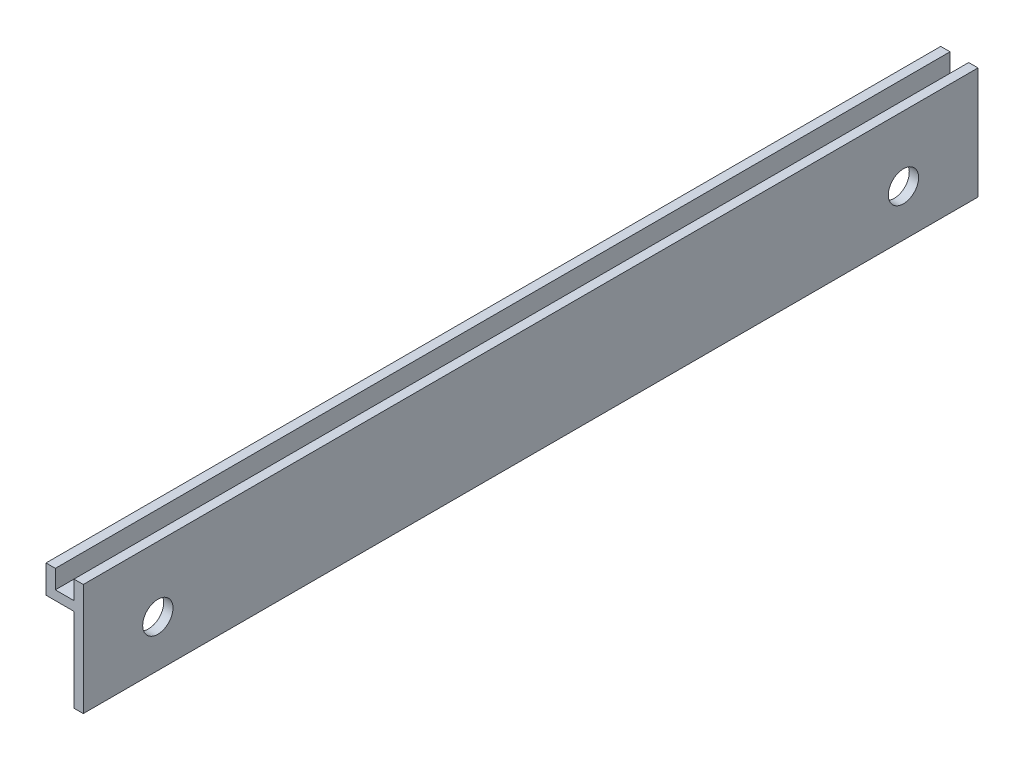
ISO-10303-21;
HEADER;
FILE_DESCRIPTION(('STEP AP214'),'2;1');
FILE_NAME('part.step','',(''),(''),'','','');
FILE_SCHEMA(('AUTOMOTIVE_DESIGN { 1 0 10303 214 1 1 1 1 }'));
ENDSEC;
DATA;
#1=APPLICATION_CONTEXT('core data for automotive mechanical design processes');
#2=APPLICATION_PROTOCOL_DEFINITION('international standard','automotive_design',2000,#1);
#3=PRODUCT_CONTEXT('',#1,'mechanical');
#4=PRODUCT('Part','Part','',(#3));
#5=PRODUCT_RELATED_PRODUCT_CATEGORY('part','',(#4));
#6=PRODUCT_DEFINITION_FORMATION('','',#4);
#7=PRODUCT_DEFINITION_CONTEXT('part definition',#1,'design');
#8=PRODUCT_DEFINITION('design','',#6,#7);
#9=PRODUCT_DEFINITION_SHAPE('','',#8);
#10=(LENGTH_UNIT() NAMED_UNIT(*) SI_UNIT(.MILLI.,.METRE.));
#11=(NAMED_UNIT(*) PLANE_ANGLE_UNIT() SI_UNIT($,.RADIAN.));
#12=(NAMED_UNIT(*) SI_UNIT($,.STERADIAN.) SOLID_ANGLE_UNIT());
#13=UNCERTAINTY_MEASURE_WITH_UNIT(LENGTH_MEASURE(1.E-05),#10,'distance_accuracy_value','');
#14=(GEOMETRIC_REPRESENTATION_CONTEXT(3) GLOBAL_UNCERTAINTY_ASSIGNED_CONTEXT((#13)) GLOBAL_UNIT_ASSIGNED_CONTEXT((#10,
#11,#12)) REPRESENTATION_CONTEXT('',''));
#15=CARTESIAN_POINT('',(0.,0.,0.));
#16=DIRECTION('',(0.,0.,1.));
#17=DIRECTION('',(1.,0.,0.));
#18=AXIS2_PLACEMENT_3D('',#15,#16,#17);
#19=CARTESIAN_POINT('',(-6.35,19.05,152.4));
#20=DIRECTION('',(1.,0.,0.));
#21=DIRECTION('',(0.,1.,0.));
#22=AXIS2_PLACEMENT_3D('',#19,#20,#21);
#23=PLANE('',#22);
#24=DIRECTION('',(0.,-1.,0.));
#25=VECTOR('',#24,1.);
#26=CARTESIAN_POINT('',(-6.35,19.05,0.));
#27=LINE('',#26,#25);
#28=CARTESIAN_POINT('',(-6.35,19.05,0.));
#29=VERTEX_POINT('',#28);
#30=CARTESIAN_POINT('',(-6.35,14.2875,0.));
#31=VERTEX_POINT('',#30);
#32=EDGE_CURVE('E141',#29,#31,#27,.T.);
#33=ORIENTED_EDGE('',*,*,#32,.T.);
#34=DIRECTION('',(0.,0.,-1.));
#35=VECTOR('',#34,1.);
#36=CARTESIAN_POINT('',(-6.35,14.2875,152.4));
#37=LINE('',#36,#35);
#38=CARTESIAN_POINT('',(-6.35,14.2875,152.4));
#39=VERTEX_POINT('',#38);
#40=EDGE_CURVE('E11',#39,#31,#37,.T.);
#41=ORIENTED_EDGE('',*,*,#40,.F.);
#42=DIRECTION('',(0.,-1.,0.));
#43=VECTOR('',#42,1.);
#44=CARTESIAN_POINT('',(-6.35,19.05,152.4));
#45=LINE('',#44,#43);
#46=CARTESIAN_POINT('',(-6.35,19.05,152.4));
#47=VERTEX_POINT('',#46);
#48=EDGE_CURVE('E160',#47,#39,#45,.T.);
#49=ORIENTED_EDGE('',*,*,#48,.F.);
#50=DIRECTION('',(0.,0.,-1.));
#51=VECTOR('',#50,1.);
#52=CARTESIAN_POINT('',(-6.35,19.05,152.4));
#53=LINE('',#52,#51);
#54=EDGE_CURVE('E137',#47,#29,#53,.T.);
#55=ORIENTED_EDGE('',*,*,#54,.T.);
#56=EDGE_LOOP('',(#33,#41,#49,#55));
#57=FACE_BOUND('',#56,.T.);
#58=ADVANCED_FACE('F33',(#57),#23,.F.);
#59=CARTESIAN_POINT('',(-1.5875,14.2875,152.4));
#60=DIRECTION('',(0.,1.,0.));
#61=DIRECTION('',(0.,0.,1.));
#62=AXIS2_PLACEMENT_3D('',#59,#60,#61);
#63=PLANE('',#62);
#64=DIRECTION('',(1.,0.,0.));
#65=VECTOR('',#64,1.);
#66=CARTESIAN_POINT('',(-1.5875,14.2875,0.));
#67=LINE('',#66,#65);
#68=CARTESIAN_POINT('',(-1.5875,14.2875,0.));
#69=VERTEX_POINT('',#68);
#70=EDGE_CURVE('E144',#31,#69,#67,.T.);
#71=ORIENTED_EDGE('',*,*,#70,.T.);
#72=DIRECTION('',(0.,0.,-1.));
#73=VECTOR('',#72,1.);
#74=CARTESIAN_POINT('',(-1.5875,14.2875,152.4));
#75=LINE('',#74,#73);
#76=CARTESIAN_POINT('',(-1.5875,14.2875,152.4));
#77=VERTEX_POINT('',#76);
#78=EDGE_CURVE('E41',#77,#69,#75,.T.);
#79=ORIENTED_EDGE('',*,*,#78,.F.);
#80=DIRECTION('',(1.,0.,0.));
#81=VECTOR('',#80,1.);
#82=CARTESIAN_POINT('',(-1.5875,14.2875,152.4));
#83=LINE('',#82,#81);
#84=EDGE_CURVE('E98',#39,#77,#83,.T.);
#85=ORIENTED_EDGE('',*,*,#84,.F.);
#86=ORIENTED_EDGE('',*,*,#40,.T.);
#87=EDGE_LOOP('',(#71,#79,#85,#86));
#88=FACE_BOUND('',#87,.T.);
#89=ADVANCED_FACE('F230',(#88),#63,.F.);
#90=CARTESIAN_POINT('',(-1.5875,14.2875,152.4));
#91=DIRECTION('',(1.,0.,0.));
#92=DIRECTION('',(0.,1.,0.));
#93=AXIS2_PLACEMENT_3D('',#90,#91,#92);
#94=PLANE('',#93);
#95=CARTESIAN_POINT('',(-1.5875,7.9375,12.7));
#96=DIRECTION('',(-1.,0.,0.));
#97=DIRECTION('',(0.,-1.,0.));
#98=AXIS2_PLACEMENT_3D('',#95,#96,#97);
#99=CIRCLE('',#98,2.5796875);
#100=CARTESIAN_POINT('',(-1.5875,5.3578125,12.7));
#101=VERTEX_POINT('',#100);
#102=EDGE_CURVE('E213',#101,#101,#99,.T.);
#103=ORIENTED_EDGE('',*,*,#102,.F.);
#104=EDGE_LOOP('',(#103));
#105=FACE_BOUND('',#104,.T.);
#106=CARTESIAN_POINT('',(-1.5875,7.9375,139.7));
#107=DIRECTION('',(-1.,0.,0.));
#108=DIRECTION('',(0.,-1.,0.));
#109=AXIS2_PLACEMENT_3D('',#106,#107,#108);
#110=CIRCLE('',#109,2.57968750000001);
#111=CARTESIAN_POINT('',(-1.5875,5.35781249999999,139.7));
#112=VERTEX_POINT('',#111);
#113=EDGE_CURVE('E207',#112,#112,#110,.T.);
#114=ORIENTED_EDGE('',*,*,#113,.F.);
#115=EDGE_LOOP('',(#114));
#116=FACE_BOUND('',#115,.T.);
#117=DIRECTION('',(0.,-1.,0.));
#118=VECTOR('',#117,1.);
#119=CARTESIAN_POINT('',(-1.5875,14.2875,0.));
#120=LINE('',#119,#118);
#121=CARTESIAN_POINT('',(-1.5875,0.,0.));
#122=VERTEX_POINT('',#121);
#123=EDGE_CURVE('E147',#69,#122,#120,.T.);
#124=ORIENTED_EDGE('',*,*,#123,.T.);
#125=DIRECTION('',(0.,0.,-1.));
#126=VECTOR('',#125,1.);
#127=CARTESIAN_POINT('',(-1.5875,0.,152.4));
#128=LINE('',#127,#126);
#129=CARTESIAN_POINT('',(-1.5875,0.,152.4));
#130=VERTEX_POINT('',#129);
#131=EDGE_CURVE('E173',#130,#122,#128,.T.);
#132=ORIENTED_EDGE('',*,*,#131,.F.);
#133=DIRECTION('',(0.,-1.,0.));
#134=VECTOR('',#133,1.);
#135=CARTESIAN_POINT('',(-1.5875,14.2875,152.4));
#136=LINE('',#135,#134);
#137=EDGE_CURVE('E181',#77,#130,#136,.T.);
#138=ORIENTED_EDGE('',*,*,#137,.F.);
#139=ORIENTED_EDGE('',*,*,#78,.T.);
#140=EDGE_LOOP('',(#124,#132,#138,#139));
#141=FACE_BOUND('',#140,.T.);
#142=ADVANCED_FACE('F179',(#105,#116,#141),#94,.F.);
#143=CARTESIAN_POINT('',(-1.5875,0.,152.4));
#144=DIRECTION('',(0.,1.,0.));
#145=DIRECTION('',(0.,0.,1.));
#146=AXIS2_PLACEMENT_3D('',#143,#144,#145);
#147=PLANE('',#146);
#148=DIRECTION('',(1.,0.,0.));
#149=VECTOR('',#148,1.);
#150=CARTESIAN_POINT('',(-1.5875,0.,0.));
#151=LINE('',#150,#149);
#152=CARTESIAN_POINT('',(0.,0.,0.));
#153=VERTEX_POINT('',#152);
#154=EDGE_CURVE('E149',#122,#153,#151,.T.);
#155=ORIENTED_EDGE('',*,*,#154,.T.);
#156=DIRECTION('',(0.,0.,-1.));
#157=VECTOR('',#156,1.);
#158=CARTESIAN_POINT('',(0.,0.,152.4));
#159=LINE('',#158,#157);
#160=CARTESIAN_POINT('',(0.,0.,152.4));
#161=VERTEX_POINT('',#160);
#162=EDGE_CURVE('E170',#161,#153,#159,.T.);
#163=ORIENTED_EDGE('',*,*,#162,.F.);
#164=DIRECTION('',(1.,0.,0.));
#165=VECTOR('',#164,1.);
#166=CARTESIAN_POINT('',(-1.5875,0.,152.4));
#167=LINE('',#166,#165);
#168=EDGE_CURVE('E199',#130,#161,#167,.T.);
#169=ORIENTED_EDGE('',*,*,#168,.F.);
#170=ORIENTED_EDGE('',*,*,#131,.T.);
#171=EDGE_LOOP('',(#155,#163,#169,#170));
#172=FACE_BOUND('',#171,.T.);
#173=ADVANCED_FACE('F190',(#172),#147,.F.);
#174=CARTESIAN_POINT('',(0.,19.05,152.4));
#175=DIRECTION('',(-1.,0.,0.));
#176=DIRECTION('',(0.,0.,1.));
#177=AXIS2_PLACEMENT_3D('',#174,#175,#176);
#178=PLANE('',#177);
#179=CARTESIAN_POINT('',(0.,7.9375,12.7));
#180=DIRECTION('',(-1.,0.,0.));
#181=DIRECTION('',(0.,-1.,0.));
#182=AXIS2_PLACEMENT_3D('',#179,#180,#181);
#183=CIRCLE('',#182,2.5796875);
#184=CARTESIAN_POINT('',(0.,5.3578125,12.7));
#185=VERTEX_POINT('',#184);
#186=EDGE_CURVE('E145',#185,#185,#183,.T.);
#187=ORIENTED_EDGE('',*,*,#186,.T.);
#188=EDGE_LOOP('',(#187));
#189=FACE_BOUND('',#188,.T.);
#190=CARTESIAN_POINT('',(0.,7.9375,139.7));
#191=DIRECTION('',(-1.,0.,0.));
#192=DIRECTION('',(0.,-1.,0.));
#193=AXIS2_PLACEMENT_3D('',#190,#191,#192);
#194=CIRCLE('',#193,2.57968750000001);
#195=CARTESIAN_POINT('',(0.,5.35781249999999,139.7));
#196=VERTEX_POINT('',#195);
#197=EDGE_CURVE('E210',#196,#196,#194,.T.);
#198=ORIENTED_EDGE('',*,*,#197,.T.);
#199=EDGE_LOOP('',(#198));
#200=FACE_BOUND('',#199,.T.);
#201=DIRECTION('',(0.,1.,0.));
#202=VECTOR('',#201,1.);
#203=CARTESIAN_POINT('',(0.,19.05,0.));
#204=LINE('',#203,#202);
#205=CARTESIAN_POINT('',(0.,19.05,0.));
#206=VERTEX_POINT('',#205);
#207=EDGE_CURVE('E151',#153,#206,#204,.T.);
#208=ORIENTED_EDGE('',*,*,#207,.T.);
#209=DIRECTION('',(0.,0.,-1.));
#210=VECTOR('',#209,1.);
#211=CARTESIAN_POINT('',(0.,19.05,152.4));
#212=LINE('',#211,#210);
#213=CARTESIAN_POINT('',(0.,19.05,152.4));
#214=VERTEX_POINT('',#213);
#215=EDGE_CURVE('E167',#214,#206,#212,.T.);
#216=ORIENTED_EDGE('',*,*,#215,.F.);
#217=DIRECTION('',(0.,1.,0.));
#218=VECTOR('',#217,1.);
#219=CARTESIAN_POINT('',(0.,19.05,152.4));
#220=LINE('',#219,#218);
#221=EDGE_CURVE('E196',#161,#214,#220,.T.);
#222=ORIENTED_EDGE('',*,*,#221,.F.);
#223=ORIENTED_EDGE('',*,*,#162,.T.);
#224=EDGE_LOOP('',(#208,#216,#222,#223));
#225=FACE_BOUND('',#224,.T.);
#226=ADVANCED_FACE('F194',(#189,#200,#225),#178,.F.);
#227=CARTESIAN_POINT('',(-1.5875,19.05,152.4));
#228=DIRECTION('',(0.,-1.,0.));
#229=DIRECTION('',(0.,0.,-1.));
#230=AXIS2_PLACEMENT_3D('',#227,#228,#229);
#231=PLANE('',#230);
#232=DIRECTION('',(-1.,0.,0.));
#233=VECTOR('',#232,1.);
#234=CARTESIAN_POINT('',(-1.5875,19.05,0.));
#235=LINE('',#234,#233);
#236=CARTESIAN_POINT('',(-1.5875,19.05,0.));
#237=VERTEX_POINT('',#236);
#238=EDGE_CURVE('E153',#206,#237,#235,.T.);
#239=ORIENTED_EDGE('',*,*,#238,.T.);
#240=DIRECTION('',(0.,0.,-1.));
#241=VECTOR('',#240,1.);
#242=CARTESIAN_POINT('',(-1.5875,19.05,152.4));
#243=LINE('',#242,#241);
#244=CARTESIAN_POINT('',(-1.5875,19.05,152.4));
#245=VERTEX_POINT('',#244);
#246=EDGE_CURVE('E164',#245,#237,#243,.T.);
#247=ORIENTED_EDGE('',*,*,#246,.F.);
#248=DIRECTION('',(-1.,0.,0.));
#249=VECTOR('',#248,1.);
#250=CARTESIAN_POINT('',(-1.5875,19.05,152.4));
#251=LINE('',#250,#249);
#252=EDGE_CURVE('E198',#214,#245,#251,.T.);
#253=ORIENTED_EDGE('',*,*,#252,.F.);
#254=ORIENTED_EDGE('',*,*,#215,.T.);
#255=EDGE_LOOP('',(#239,#247,#253,#254));
#256=FACE_BOUND('',#255,.T.);
#257=ADVANCED_FACE('F255',(#256),#231,.F.);
#258=CARTESIAN_POINT('',(-1.5875,15.875,152.4));
#259=DIRECTION('',(1.,0.,0.));
#260=DIRECTION('',(0.,0.,-1.));
#261=AXIS2_PLACEMENT_3D('',#258,#259,#260);
#262=PLANE('',#261);
#263=DIRECTION('',(0.,-1.,0.));
#264=VECTOR('',#263,1.);
#265=CARTESIAN_POINT('',(-1.5875,15.875,0.));
#266=LINE('',#265,#264);
#267=CARTESIAN_POINT('',(-1.5875,15.875,0.));
#268=VERTEX_POINT('',#267);
#269=EDGE_CURVE('E155',#237,#268,#266,.T.);
#270=ORIENTED_EDGE('',*,*,#269,.T.);
#271=DIRECTION('',(0.,0.,-1.));
#272=VECTOR('',#271,1.);
#273=CARTESIAN_POINT('',(-1.5875,15.875,152.4));
#274=LINE('',#273,#272);
#275=CARTESIAN_POINT('',(-1.5875,15.875,152.4));
#276=VERTEX_POINT('',#275);
#277=EDGE_CURVE('E132',#276,#268,#274,.T.);
#278=ORIENTED_EDGE('',*,*,#277,.F.);
#279=DIRECTION('',(0.,-1.,0.));
#280=VECTOR('',#279,1.);
#281=CARTESIAN_POINT('',(-1.5875,15.875,152.4));
#282=LINE('',#281,#280);
#283=EDGE_CURVE('E123',#245,#276,#282,.T.);
#284=ORIENTED_EDGE('',*,*,#283,.F.);
#285=ORIENTED_EDGE('',*,*,#246,.T.);
#286=EDGE_LOOP('',(#270,#278,#284,#285));
#287=FACE_BOUND('',#286,.T.);
#288=ADVANCED_FACE('F252',(#287),#262,.F.);
#289=CARTESIAN_POINT('',(-4.7625,15.875,152.4));
#290=DIRECTION('',(0.,-1.,0.));
#291=DIRECTION('',(0.,0.,-1.));
#292=AXIS2_PLACEMENT_3D('',#289,#290,#291);
#293=PLANE('',#292);
#294=DIRECTION('',(-1.,0.,0.));
#295=VECTOR('',#294,1.);
#296=CARTESIAN_POINT('',(-4.7625,15.875,0.));
#297=LINE('',#296,#295);
#298=CARTESIAN_POINT('',(-4.7625,15.875,0.));
#299=VERTEX_POINT('',#298);
#300=EDGE_CURVE('E131',#268,#299,#297,.T.);
#301=ORIENTED_EDGE('',*,*,#300,.T.);
#302=DIRECTION('',(0.,0.,-1.));
#303=VECTOR('',#302,1.);
#304=CARTESIAN_POINT('',(-4.7625,15.875,152.4));
#305=LINE('',#304,#303);
#306=CARTESIAN_POINT('',(-4.7625,15.875,152.4));
#307=VERTEX_POINT('',#306);
#308=EDGE_CURVE('E128',#307,#299,#305,.T.);
#309=ORIENTED_EDGE('',*,*,#308,.F.);
#310=DIRECTION('',(-1.,0.,0.));
#311=VECTOR('',#310,1.);
#312=CARTESIAN_POINT('',(-4.7625,15.875,152.4));
#313=LINE('',#312,#311);
#314=EDGE_CURVE('E117',#276,#307,#313,.T.);
#315=ORIENTED_EDGE('',*,*,#314,.F.);
#316=ORIENTED_EDGE('',*,*,#277,.T.);
#317=EDGE_LOOP('',(#301,#309,#315,#316));
#318=FACE_BOUND('',#317,.T.);
#319=ADVANCED_FACE('F129',(#318),#293,.F.);
#320=CARTESIAN_POINT('',(-4.7625,19.05,152.4));
#321=DIRECTION('',(-1.,0.,0.));
#322=DIRECTION('',(0.,0.,1.));
#323=AXIS2_PLACEMENT_3D('',#320,#321,#322);
#324=PLANE('',#323);
#325=DIRECTION('',(0.,1.,0.));
#326=VECTOR('',#325,1.);
#327=CARTESIAN_POINT('',(-4.7625,19.05,0.));
#328=LINE('',#327,#326);
#329=CARTESIAN_POINT('',(-4.7625,19.05,0.));
#330=VERTEX_POINT('',#329);
#331=EDGE_CURVE('E84',#299,#330,#328,.T.);
#332=ORIENTED_EDGE('',*,*,#331,.T.);
#333=DIRECTION('',(0.,0.,-1.));
#334=VECTOR('',#333,1.);
#335=CARTESIAN_POINT('',(-4.7625,19.05,152.4));
#336=LINE('',#335,#334);
#337=CARTESIAN_POINT('',(-4.7625,19.05,152.4));
#338=VERTEX_POINT('',#337);
#339=EDGE_CURVE('E133',#338,#330,#336,.T.);
#340=ORIENTED_EDGE('',*,*,#339,.F.);
#341=DIRECTION('',(0.,1.,0.));
#342=VECTOR('',#341,1.);
#343=CARTESIAN_POINT('',(-4.7625,19.05,152.4));
#344=LINE('',#343,#342);
#345=EDGE_CURVE('E121',#307,#338,#344,.T.);
#346=ORIENTED_EDGE('',*,*,#345,.F.);
#347=ORIENTED_EDGE('',*,*,#308,.T.);
#348=EDGE_LOOP('',(#332,#340,#346,#347));
#349=FACE_BOUND('',#348,.T.);
#350=ADVANCED_FACE('F135',(#349),#324,.F.);
#351=CARTESIAN_POINT('',(-6.35,19.05,152.4));
#352=DIRECTION('',(0.,-1.,0.));
#353=DIRECTION('',(0.,0.,-1.));
#354=AXIS2_PLACEMENT_3D('',#351,#352,#353);
#355=PLANE('',#354);
#356=DIRECTION('',(-1.,0.,0.));
#357=VECTOR('',#356,1.);
#358=CARTESIAN_POINT('',(-6.35,19.05,0.));
#359=LINE('',#358,#357);
#360=EDGE_CURVE('E90',#330,#29,#359,.T.);
#361=ORIENTED_EDGE('',*,*,#360,.T.);
#362=ORIENTED_EDGE('',*,*,#54,.F.);
#363=DIRECTION('',(-1.,0.,0.));
#364=VECTOR('',#363,1.);
#365=CARTESIAN_POINT('',(-6.35,19.05,152.4));
#366=LINE('',#365,#364);
#367=EDGE_CURVE('E49',#338,#47,#366,.T.);
#368=ORIENTED_EDGE('',*,*,#367,.F.);
#369=ORIENTED_EDGE('',*,*,#339,.T.);
#370=EDGE_LOOP('',(#361,#362,#368,#369));
#371=FACE_BOUND('',#370,.T.);
#372=ADVANCED_FACE('F304',(#371),#355,.F.);
#373=CARTESIAN_POINT('',(0.,0.,152.4));
#374=DIRECTION('',(0.,0.,-1.));
#375=DIRECTION('',(-1.,0.,0.));
#376=AXIS2_PLACEMENT_3D('',#373,#374,#375);
#377=PLANE('',#376);
#378=ORIENTED_EDGE('',*,*,#48,.T.);
#379=ORIENTED_EDGE('',*,*,#84,.T.);
#380=ORIENTED_EDGE('',*,*,#137,.T.);
#381=ORIENTED_EDGE('',*,*,#168,.T.);
#382=ORIENTED_EDGE('',*,*,#221,.T.);
#383=ORIENTED_EDGE('',*,*,#252,.T.);
#384=ORIENTED_EDGE('',*,*,#283,.T.);
#385=ORIENTED_EDGE('',*,*,#314,.T.);
#386=ORIENTED_EDGE('',*,*,#345,.T.);
#387=ORIENTED_EDGE('',*,*,#367,.T.);
#388=EDGE_LOOP('',(#378,#379,#380,#381,#382,#383,#384,#385,#386,#387));
#389=FACE_BOUND('',#388,.T.);
#390=ADVANCED_FACE('F119',(#389),#377,.F.);
#391=CARTESIAN_POINT('',(0.,0.,0.));
#392=DIRECTION('',(0.,0.,-1.));
#393=DIRECTION('',(-1.,0.,0.));
#394=AXIS2_PLACEMENT_3D('',#391,#392,#393);
#395=PLANE('',#394);
#396=ORIENTED_EDGE('',*,*,#32,.F.);
#397=ORIENTED_EDGE('',*,*,#360,.F.);
#398=ORIENTED_EDGE('',*,*,#331,.F.);
#399=ORIENTED_EDGE('',*,*,#300,.F.);
#400=ORIENTED_EDGE('',*,*,#269,.F.);
#401=ORIENTED_EDGE('',*,*,#238,.F.);
#402=ORIENTED_EDGE('',*,*,#207,.F.);
#403=ORIENTED_EDGE('',*,*,#154,.F.);
#404=ORIENTED_EDGE('',*,*,#123,.F.);
#405=ORIENTED_EDGE('',*,*,#70,.F.);
#406=EDGE_LOOP('',(#396,#397,#398,#399,#400,#401,#402,#403,#404,#405));
#407=FACE_BOUND('',#406,.T.);
#408=ADVANCED_FACE('F185',(#407),#395,.T.);
#409=CARTESIAN_POINT('',(0.,7.9375,139.7));
#410=DIRECTION('',(-1.,0.,0.));
#411=DIRECTION('',(0.,-1.,0.));
#412=AXIS2_PLACEMENT_3D('',#409,#410,#411);
#413=CYLINDRICAL_SURFACE('',#412,2.57968750000001);
#414=ORIENTED_EDGE('',*,*,#197,.F.);
#415=EDGE_LOOP('',(#414));
#416=FACE_BOUND('',#415,.T.);
#417=ORIENTED_EDGE('',*,*,#113,.T.);
#418=EDGE_LOOP('',(#417));
#419=FACE_BOUND('',#418,.T.);
#420=ADVANCED_FACE('F224',(#416,#419),#413,.F.);
#421=CARTESIAN_POINT('',(0.,7.9375,12.7));
#422=DIRECTION('',(-1.,0.,0.));
#423=DIRECTION('',(0.,-1.,0.));
#424=AXIS2_PLACEMENT_3D('',#421,#422,#423);
#425=CYLINDRICAL_SURFACE('',#424,2.5796875);
#426=ORIENTED_EDGE('',*,*,#186,.F.);
#427=EDGE_LOOP('',(#426));
#428=FACE_BOUND('',#427,.T.);
#429=ORIENTED_EDGE('',*,*,#102,.T.);
#430=EDGE_LOOP('',(#429));
#431=FACE_BOUND('',#430,.T.);
#432=ADVANCED_FACE('F221',(#428,#431),#425,.F.);
#433=CLOSED_SHELL('',(#58,#89,#142,#173,#226,#257,#288,#319,#350,#372,#390,#408,#420,#432));
#434=MANIFOLD_SOLID_BREP('B2',#433);
#435=ADVANCED_BREP_SHAPE_REPRESENTATION('',(#18,#434),#14);
#436=SHAPE_DEFINITION_REPRESENTATION(#9,#435);
ENDSEC;
END-ISO-10303-21;
